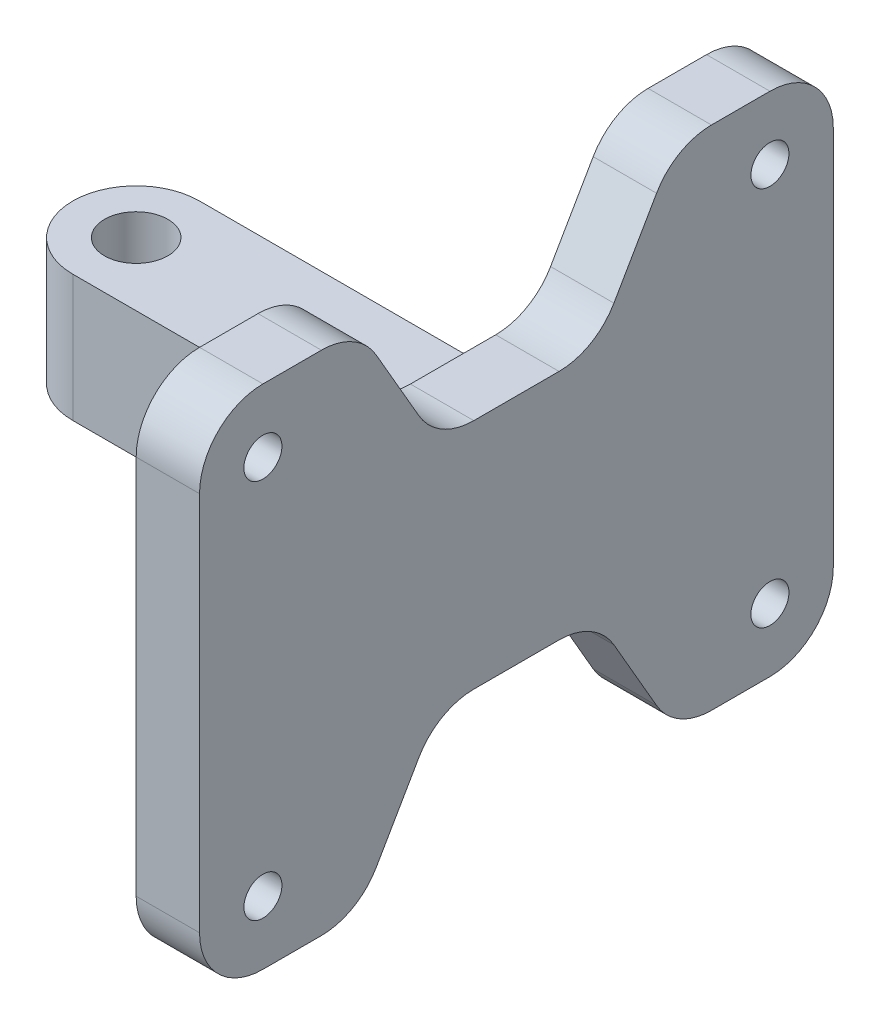
ISO-10303-21;
HEADER;
FILE_DESCRIPTION(('STEP AP214'),'2;1');
FILE_NAME('part.step','',(''),(''),'','','');
FILE_SCHEMA(('AUTOMOTIVE_DESIGN { 1 0 10303 214 1 1 1 1 }'));
ENDSEC;
DATA;
#1=APPLICATION_CONTEXT('core data for automotive mechanical design processes');
#2=APPLICATION_PROTOCOL_DEFINITION('international standard','automotive_design',2000,#1);
#3=PRODUCT_CONTEXT('',#1,'mechanical');
#4=PRODUCT('Part','Part','',(#3));
#5=PRODUCT_RELATED_PRODUCT_CATEGORY('part','',(#4));
#6=PRODUCT_DEFINITION_FORMATION('','',#4);
#7=PRODUCT_DEFINITION_CONTEXT('part definition',#1,'design');
#8=PRODUCT_DEFINITION('design','',#6,#7);
#9=PRODUCT_DEFINITION_SHAPE('','',#8);
#10=(LENGTH_UNIT() NAMED_UNIT(*) SI_UNIT(.MILLI.,.METRE.));
#11=(NAMED_UNIT(*) PLANE_ANGLE_UNIT() SI_UNIT($,.RADIAN.));
#12=(NAMED_UNIT(*) SI_UNIT($,.STERADIAN.) SOLID_ANGLE_UNIT());
#13=UNCERTAINTY_MEASURE_WITH_UNIT(LENGTH_MEASURE(1.E-05),#10,'distance_accuracy_value','');
#14=(GEOMETRIC_REPRESENTATION_CONTEXT(3) GLOBAL_UNCERTAINTY_ASSIGNED_CONTEXT((#13)) GLOBAL_UNIT_ASSIGNED_CONTEXT((#10,
#11,#12)) REPRESENTATION_CONTEXT('',''));
#15=CARTESIAN_POINT('',(0.,0.,0.));
#16=DIRECTION('',(0.,0.,1.));
#17=DIRECTION('',(1.,0.,0.));
#18=AXIS2_PLACEMENT_3D('',#15,#16,#17);
#19=CARTESIAN_POINT('',(-50.,-10.,0.));
#20=DIRECTION('',(0.,-1.,0.));
#21=DIRECTION('',(0.,0.,-1.));
#22=AXIS2_PLACEMENT_3D('',#19,#20,#21);
#23=CYLINDRICAL_SURFACE('',#22,10.);
#24=DIRECTION('',(0.,1.,0.));
#25=VECTOR('',#24,1.);
#26=CARTESIAN_POINT('',(-50.,-10.,-10.));
#27=LINE('',#26,#25);
#28=CARTESIAN_POINT('',(-50.,-10.,-10.));
#29=VERTEX_POINT('',#28);
#30=CARTESIAN_POINT('',(-50.,10.,-10.));
#31=VERTEX_POINT('',#30);
#32=EDGE_CURVE('E441',#29,#31,#27,.T.);
#33=ORIENTED_EDGE('',*,*,#32,.F.);
#34=CARTESIAN_POINT('',(-50.,-10.,0.));
#35=DIRECTION('',(0.,1.,0.));
#36=DIRECTION('',(0.,0.,1.));
#37=AXIS2_PLACEMENT_3D('',#34,#35,#36);
#38=CIRCLE('',#37,10.);
#39=CARTESIAN_POINT('',(-50.,-10.,10.));
#40=VERTEX_POINT('',#39);
#41=EDGE_CURVE('E39',#40,#29,#38,.F.);
#42=ORIENTED_EDGE('',*,*,#41,.F.);
#43=DIRECTION('',(0.,1.,0.));
#44=VECTOR('',#43,1.);
#45=CARTESIAN_POINT('',(-50.,-10.,10.));
#46=LINE('',#45,#44);
#47=CARTESIAN_POINT('',(-50.,10.,10.));
#48=VERTEX_POINT('',#47);
#49=EDGE_CURVE('E218',#48,#40,#46,.F.);
#50=ORIENTED_EDGE('',*,*,#49,.F.);
#51=CARTESIAN_POINT('',(-50.,10.,0.));
#52=DIRECTION('',(0.,-1.,0.));
#53=DIRECTION('',(0.,0.,-1.));
#54=AXIS2_PLACEMENT_3D('',#51,#52,#53);
#55=CIRCLE('',#54,10.);
#56=EDGE_CURVE('E11',#31,#48,#55,.F.);
#57=ORIENTED_EDGE('',*,*,#56,.F.);
#58=EDGE_LOOP('',(#33,#42,#50,#57));
#59=FACE_BOUND('',#58,.T.);
#60=ADVANCED_FACE('F31',(#59),#23,.T.);
#61=CARTESIAN_POINT('',(0.,40.,50.));
#62=DIRECTION('',(1.,0.,0.));
#63=DIRECTION('',(0.,0.,-1.));
#64=AXIS2_PLACEMENT_3D('',#61,#62,#63);
#65=PLANE('',#64);
#66=DIRECTION('',(0.,-0.866025403784439,0.5));
#67=VECTOR('',#66,1.);
#68=CARTESIAN_POINT('',(0.,-40.,25.));
#69=LINE('',#68,#67);
#70=CARTESIAN_POINT('',(0.,-23.349364905389,15.3867513459481));
#71=VERTEX_POINT('',#70);
#72=CARTESIAN_POINT('',(0.,-35.,22.1132486540518));
#73=VERTEX_POINT('',#72);
#74=EDGE_CURVE('E277',#71,#73,#69,.T.);
#75=ORIENTED_EDGE('',*,*,#74,.T.);
#76=CARTESIAN_POINT('',(0.,-30.,30.7735026918962));
#77=DIRECTION('',(1.,0.,0.));
#78=DIRECTION('',(0.,0.,-1.));
#79=AXIS2_PLACEMENT_3D('',#76,#77,#78);
#80=CIRCLE('',#79,10.);
#81=CARTESIAN_POINT('',(0.,-40.,30.7735026918962));
#82=VERTEX_POINT('',#81);
#83=EDGE_CURVE('E384',#73,#82,#80,.F.);
#84=ORIENTED_EDGE('',*,*,#83,.T.);
#85=DIRECTION('',(0.,0.,-1.));
#86=VECTOR('',#85,1.);
#87=CARTESIAN_POINT('',(0.,-40.,-50.));
#88=LINE('',#87,#86);
#89=CARTESIAN_POINT('',(0.,-40.,40.));
#90=VERTEX_POINT('',#89);
#91=EDGE_CURVE('E326',#90,#82,#88,.T.);
#92=ORIENTED_EDGE('',*,*,#91,.F.);
#93=CARTESIAN_POINT('',(0.,-30.,40.));
#94=DIRECTION('',(1.,0.,0.));
#95=DIRECTION('',(0.,0.,-1.));
#96=AXIS2_PLACEMENT_3D('',#93,#94,#95);
#97=CIRCLE('',#96,10.);
#98=CARTESIAN_POINT('',(0.,-30.,50.));
#99=VERTEX_POINT('',#98);
#100=EDGE_CURVE('E382',#90,#99,#97,.F.);
#101=ORIENTED_EDGE('',*,*,#100,.T.);
#102=DIRECTION('',(0.,-1.,0.));
#103=VECTOR('',#102,1.);
#104=CARTESIAN_POINT('',(0.,-40.,50.));
#105=LINE('',#104,#103);
#106=CARTESIAN_POINT('',(0.,30.,50.));
#107=VERTEX_POINT('',#106);
#108=EDGE_CURVE('E298',#107,#99,#105,.T.);
#109=ORIENTED_EDGE('',*,*,#108,.F.);
#110=CARTESIAN_POINT('',(0.,30.,40.));
#111=DIRECTION('',(1.,0.,0.));
#112=DIRECTION('',(0.,0.,-1.));
#113=AXIS2_PLACEMENT_3D('',#110,#111,#112);
#114=CIRCLE('',#113,10.);
#115=CARTESIAN_POINT('',(0.,40.,40.));
#116=VERTEX_POINT('',#115);
#117=EDGE_CURVE('E380',#107,#116,#114,.F.);
#118=ORIENTED_EDGE('',*,*,#117,.T.);
#119=DIRECTION('',(0.,0.,1.));
#120=VECTOR('',#119,1.);
#121=CARTESIAN_POINT('',(0.,40.,-50.));
#122=LINE('',#121,#120);
#123=CARTESIAN_POINT('',(0.,40.,30.7735026918963));
#124=VERTEX_POINT('',#123);
#125=EDGE_CURVE('E330',#124,#116,#122,.T.);
#126=ORIENTED_EDGE('',*,*,#125,.F.);
#127=CARTESIAN_POINT('',(0.,30.,30.7735026918962));
#128=DIRECTION('',(1.,0.,0.));
#129=DIRECTION('',(0.,0.,-1.));
#130=AXIS2_PLACEMENT_3D('',#127,#128,#129);
#131=CIRCLE('',#130,10.);
#132=CARTESIAN_POINT('',(0.,35.,22.1132486540519));
#133=VERTEX_POINT('',#132);
#134=EDGE_CURVE('E378',#124,#133,#131,.F.);
#135=ORIENTED_EDGE('',*,*,#134,.T.);
#136=DIRECTION('',(0.,-0.866025403784439,-0.5));
#137=VECTOR('',#136,1.);
#138=CARTESIAN_POINT('',(0.,40.,25.));
#139=LINE('',#138,#137);
#140=CARTESIAN_POINT('',(0.,23.349364905389,15.3867513459481));
#141=VERTEX_POINT('',#140);
#142=EDGE_CURVE('E288',#133,#141,#139,.T.);
#143=ORIENTED_EDGE('',*,*,#142,.T.);
#144=CARTESIAN_POINT('',(0.,28.349364905389,6.72649730810373));
#145=DIRECTION('',(1.,0.,0.));
#146=DIRECTION('',(0.,0.,-1.));
#147=AXIS2_PLACEMENT_3D('',#144,#145,#146);
#148=CIRCLE('',#147,10.);
#149=CARTESIAN_POINT('',(0.,18.349364905389,6.72649730810373));
#150=VERTEX_POINT('',#149);
#151=EDGE_CURVE('E435',#141,#150,#148,.T.);
#152=ORIENTED_EDGE('',*,*,#151,.T.);
#153=DIRECTION('',(0.,0.,-1.));
#154=VECTOR('',#153,1.);
#155=CARTESIAN_POINT('',(0.,18.349364905389,12.5));
#156=LINE('',#155,#154);
#157=CARTESIAN_POINT('',(0.,18.349364905389,-6.72649730810377));
#158=VERTEX_POINT('',#157);
#159=EDGE_CURVE('E291',#150,#158,#156,.T.);
#160=ORIENTED_EDGE('',*,*,#159,.T.);
#161=CARTESIAN_POINT('',(0.,28.349364905389,-6.72649730810377));
#162=DIRECTION('',(1.,0.,0.));
#163=DIRECTION('',(0.,0.,-1.));
#164=AXIS2_PLACEMENT_3D('',#161,#162,#163);
#165=CIRCLE('',#164,10.);
#166=CARTESIAN_POINT('',(0.,23.349364905389,-15.3867513459482));
#167=VERTEX_POINT('',#166);
#168=EDGE_CURVE('E439',#158,#167,#165,.T.);
#169=ORIENTED_EDGE('',*,*,#168,.T.);
#170=DIRECTION('',(0.,0.866025403784439,-0.5));
#171=VECTOR('',#170,1.);
#172=CARTESIAN_POINT('',(0.,18.349364905389,-12.5));
#173=LINE('',#172,#171);
#174=CARTESIAN_POINT('',(0.,35.,-22.1132486540519));
#175=VERTEX_POINT('',#174);
#176=EDGE_CURVE('E295',#167,#175,#173,.T.);
#177=ORIENTED_EDGE('',*,*,#176,.T.);
#178=CARTESIAN_POINT('',(0.,30.,-30.7735026918963));
#179=DIRECTION('',(1.,0.,0.));
#180=DIRECTION('',(0.,0.,-1.));
#181=AXIS2_PLACEMENT_3D('',#178,#179,#180);
#182=CIRCLE('',#181,10.);
#183=CARTESIAN_POINT('',(0.,40.,-30.7735026918963));
#184=VERTEX_POINT('',#183);
#185=EDGE_CURVE('E376',#175,#184,#182,.F.);
#186=ORIENTED_EDGE('',*,*,#185,.T.);
#187=CARTESIAN_POINT('',(0.,40.,-40.));
#188=VERTEX_POINT('',#187);
#189=EDGE_CURVE('E310',#188,#184,#122,.T.);
#190=ORIENTED_EDGE('',*,*,#189,.F.);
#191=CARTESIAN_POINT('',(0.,30.,-40.));
#192=DIRECTION('',(1.,0.,0.));
#193=DIRECTION('',(0.,0.,-1.));
#194=AXIS2_PLACEMENT_3D('',#191,#192,#193);
#195=CIRCLE('',#194,10.);
#196=CARTESIAN_POINT('',(0.,30.,-50.));
#197=VERTEX_POINT('',#196);
#198=EDGE_CURVE('E370',#188,#197,#195,.F.);
#199=ORIENTED_EDGE('',*,*,#198,.T.);
#200=DIRECTION('',(0.,1.,0.));
#201=VECTOR('',#200,1.);
#202=CARTESIAN_POINT('',(0.,-40.,-50.));
#203=LINE('',#202,#201);
#204=CARTESIAN_POINT('',(0.,-30.,-50.));
#205=VERTEX_POINT('',#204);
#206=EDGE_CURVE('E327',#205,#197,#203,.T.);
#207=ORIENTED_EDGE('',*,*,#206,.F.);
#208=CARTESIAN_POINT('',(0.,-30.,-40.));
#209=DIRECTION('',(1.,0.,0.));
#210=DIRECTION('',(0.,0.,-1.));
#211=AXIS2_PLACEMENT_3D('',#208,#209,#210);
#212=CIRCLE('',#211,10.);
#213=CARTESIAN_POINT('',(0.,-40.,-40.));
#214=VERTEX_POINT('',#213);
#215=EDGE_CURVE('E374',#205,#214,#212,.F.);
#216=ORIENTED_EDGE('',*,*,#215,.T.);
#217=CARTESIAN_POINT('',(0.,-40.,-30.7735026918963));
#218=VERTEX_POINT('',#217);
#219=EDGE_CURVE('E323',#218,#214,#88,.T.);
#220=ORIENTED_EDGE('',*,*,#219,.F.);
#221=CARTESIAN_POINT('',(0.,-30.,-30.7735026918963));
#222=DIRECTION('',(1.,0.,0.));
#223=DIRECTION('',(0.,0.,-1.));
#224=AXIS2_PLACEMENT_3D('',#221,#222,#223);
#225=CIRCLE('',#224,10.);
#226=CARTESIAN_POINT('',(0.,-35.,-22.1132486540519));
#227=VERTEX_POINT('',#226);
#228=EDGE_CURVE('E372',#218,#227,#225,.F.);
#229=ORIENTED_EDGE('',*,*,#228,.T.);
#230=DIRECTION('',(0.,0.866025403784439,0.5));
#231=VECTOR('',#230,1.);
#232=CARTESIAN_POINT('',(0.,-18.349364905389,-12.5));
#233=LINE('',#232,#231);
#234=CARTESIAN_POINT('',(0.,-23.349364905389,-15.3867513459482));
#235=VERTEX_POINT('',#234);
#236=EDGE_CURVE('E270',#227,#235,#233,.T.);
#237=ORIENTED_EDGE('',*,*,#236,.T.);
#238=CARTESIAN_POINT('',(0.,-28.349364905389,-6.72649730810377));
#239=DIRECTION('',(1.,0.,0.));
#240=DIRECTION('',(0.,0.,-1.));
#241=AXIS2_PLACEMENT_3D('',#238,#239,#240);
#242=CIRCLE('',#241,10.);
#243=CARTESIAN_POINT('',(0.,-18.349364905389,-6.72649730810377));
#244=VERTEX_POINT('',#243);
#245=EDGE_CURVE('E427',#235,#244,#242,.T.);
#246=ORIENTED_EDGE('',*,*,#245,.T.);
#247=DIRECTION('',(0.,0.,1.));
#248=VECTOR('',#247,1.);
#249=CARTESIAN_POINT('',(0.,-18.349364905389,12.5));
#250=LINE('',#249,#248);
#251=CARTESIAN_POINT('',(0.,-18.349364905389,6.72649730810373));
#252=VERTEX_POINT('',#251);
#253=EDGE_CURVE('E273',#244,#252,#250,.T.);
#254=ORIENTED_EDGE('',*,*,#253,.T.);
#255=CARTESIAN_POINT('',(0.,-28.349364905389,6.72649730810373));
#256=DIRECTION('',(1.,0.,0.));
#257=DIRECTION('',(0.,0.,-1.));
#258=AXIS2_PLACEMENT_3D('',#255,#256,#257);
#259=CIRCLE('',#258,10.);
#260=EDGE_CURVE('E431',#252,#71,#259,.T.);
#261=ORIENTED_EDGE('',*,*,#260,.T.);
#262=EDGE_LOOP('',(#75,#84,#92,#101,#109,#118,#126,#135,#143,#152,#160,#169,#177,#186,#190,#199,
#207,#216,#220,#229,#237,#246,#254,#261));
#263=FACE_BOUND('',#262,.T.);
#264=CARTESIAN_POINT('',(0.,30.,40.));
#265=DIRECTION('',(1.,0.,0.));
#266=DIRECTION('',(0.,0.,-1.));
#267=AXIS2_PLACEMENT_3D('',#264,#265,#266);
#268=CIRCLE('',#267,3.);
#269=CARTESIAN_POINT('',(0.,30.,37.));
#270=VERTEX_POINT('',#269);
#271=EDGE_CURVE('E264',#270,#270,#268,.T.);
#272=ORIENTED_EDGE('',*,*,#271,.T.);
#273=EDGE_LOOP('',(#272));
#274=FACE_BOUND('',#273,.T.);
#275=CARTESIAN_POINT('',(0.,30.,-40.));
#276=DIRECTION('',(1.,0.,0.));
#277=DIRECTION('',(0.,0.,1.));
#278=AXIS2_PLACEMENT_3D('',#275,#276,#277);
#279=CIRCLE('',#278,3.);
#280=CARTESIAN_POINT('',(0.,30.,-37.));
#281=VERTEX_POINT('',#280);
#282=EDGE_CURVE('E258',#281,#281,#279,.T.);
#283=ORIENTED_EDGE('',*,*,#282,.T.);
#284=EDGE_LOOP('',(#283));
#285=FACE_BOUND('',#284,.T.);
#286=CARTESIAN_POINT('',(0.,-30.,-40.));
#287=DIRECTION('',(1.,0.,0.));
#288=DIRECTION('',(0.,0.,-1.));
#289=AXIS2_PLACEMENT_3D('',#286,#287,#288);
#290=CIRCLE('',#289,3.);
#291=CARTESIAN_POINT('',(0.,-30.,-43.));
#292=VERTEX_POINT('',#291);
#293=EDGE_CURVE('E252',#292,#292,#290,.T.);
#294=ORIENTED_EDGE('',*,*,#293,.T.);
#295=EDGE_LOOP('',(#294));
#296=FACE_BOUND('',#295,.T.);
#297=CARTESIAN_POINT('',(0.,-30.,40.));
#298=DIRECTION('',(1.,0.,0.));
#299=DIRECTION('',(0.,0.,1.));
#300=AXIS2_PLACEMENT_3D('',#297,#298,#299);
#301=CIRCLE('',#300,3.);
#302=CARTESIAN_POINT('',(0.,-30.,43.));
#303=VERTEX_POINT('',#302);
#304=EDGE_CURVE('E246',#303,#303,#301,.T.);
#305=ORIENTED_EDGE('',*,*,#304,.T.);
#306=EDGE_LOOP('',(#305));
#307=FACE_BOUND('',#306,.T.);
#308=DIRECTION('',(0.,1.,0.));
#309=VECTOR('',#308,1.);
#310=CARTESIAN_POINT('',(0.,10.,10.));
#311=LINE('',#310,#309);
#312=CARTESIAN_POINT('',(0.,-10.,10.));
#313=VERTEX_POINT('',#312);
#314=CARTESIAN_POINT('',(0.,10.,10.));
#315=VERTEX_POINT('',#314);
#316=EDGE_CURVE('E217',#313,#315,#311,.T.);
#317=ORIENTED_EDGE('',*,*,#316,.F.);
#318=DIRECTION('',(0.,0.,1.));
#319=VECTOR('',#318,1.);
#320=CARTESIAN_POINT('',(0.,-10.,-10.));
#321=LINE('',#320,#319);
#322=CARTESIAN_POINT('',(0.,-10.,-10.));
#323=VERTEX_POINT('',#322);
#324=EDGE_CURVE('E222',#323,#313,#321,.T.);
#325=ORIENTED_EDGE('',*,*,#324,.F.);
#326=DIRECTION('',(0.,-1.,0.));
#327=VECTOR('',#326,1.);
#328=CARTESIAN_POINT('',(0.,10.,-10.));
#329=LINE('',#328,#327);
#330=CARTESIAN_POINT('',(0.,9.99999999999999,-10.));
#331=VERTEX_POINT('',#330);
#332=EDGE_CURVE('E235',#331,#323,#329,.T.);
#333=ORIENTED_EDGE('',*,*,#332,.F.);
#334=DIRECTION('',(0.,0.,-1.));
#335=VECTOR('',#334,1.);
#336=CARTESIAN_POINT('',(0.,10.,-10.));
#337=LINE('',#336,#335);
#338=EDGE_CURVE('E231',#315,#331,#337,.T.);
#339=ORIENTED_EDGE('',*,*,#338,.F.);
#340=EDGE_LOOP('',(#317,#325,#333,#339));
#341=FACE_BOUND('',#340,.T.);
#342=ADVANCED_FACE('F227',(#263,#274,#285,#296,#307,#341),#65,.F.);
#343=CARTESIAN_POINT('',(10.,-40.,-50.));
#344=DIRECTION('',(0.,1.,0.));
#345=DIRECTION('',(0.,0.,1.));
#346=AXIS2_PLACEMENT_3D('',#343,#344,#345);
#347=PLANE('',#346);
#348=ORIENTED_EDGE('',*,*,#219,.T.);
#349=DIRECTION('',(-1.,0.,0.));
#350=VECTOR('',#349,1.);
#351=CARTESIAN_POINT('',(10.,-40.,-40.));
#352=LINE('',#351,#350);
#353=CARTESIAN_POINT('',(10.,-40.,-40.));
#354=VERTEX_POINT('',#353);
#355=EDGE_CURVE('E423',#214,#354,#352,.F.);
#356=ORIENTED_EDGE('',*,*,#355,.T.);
#357=DIRECTION('',(0.,0.,-1.));
#358=VECTOR('',#357,1.);
#359=CARTESIAN_POINT('',(10.,-40.,-50.));
#360=LINE('',#359,#358);
#361=CARTESIAN_POINT('',(10.,-40.,-30.7735026918963));
#362=VERTEX_POINT('',#361);
#363=EDGE_CURVE('E309',#362,#354,#360,.T.);
#364=ORIENTED_EDGE('',*,*,#363,.F.);
#365=DIRECTION('',(1.,0.,0.));
#366=VECTOR('',#365,1.);
#367=CARTESIAN_POINT('',(10.,-40.,-30.7735026918963));
#368=LINE('',#367,#366);
#369=EDGE_CURVE('E421',#362,#218,#368,.F.);
#370=ORIENTED_EDGE('',*,*,#369,.T.);
#371=EDGE_LOOP('',(#348,#356,#364,#370));
#372=FACE_BOUND('',#371,.T.);
#373=ADVANCED_FACE('F468',(#372),#347,.F.);
#374=CARTESIAN_POINT('',(10.,40.,-50.));
#375=DIRECTION('',(0.,-1.,0.));
#376=DIRECTION('',(0.,0.,-1.));
#377=AXIS2_PLACEMENT_3D('',#374,#375,#376);
#378=PLANE('',#377);
#379=ORIENTED_EDGE('',*,*,#189,.T.);
#380=DIRECTION('',(1.,0.,0.));
#381=VECTOR('',#380,1.);
#382=CARTESIAN_POINT('',(10.,40.,-30.7735026918963));
#383=LINE('',#382,#381);
#384=CARTESIAN_POINT('',(10.,40.,-30.7735026918963));
#385=VERTEX_POINT('',#384);
#386=EDGE_CURVE('E413',#184,#385,#383,.T.);
#387=ORIENTED_EDGE('',*,*,#386,.T.);
#388=DIRECTION('',(0.,0.,1.));
#389=VECTOR('',#388,1.);
#390=CARTESIAN_POINT('',(10.,40.,-50.));
#391=LINE('',#390,#389);
#392=CARTESIAN_POINT('',(10.,40.,-40.));
#393=VERTEX_POINT('',#392);
#394=EDGE_CURVE('E320',#393,#385,#391,.T.);
#395=ORIENTED_EDGE('',*,*,#394,.F.);
#396=DIRECTION('',(-1.,0.,0.));
#397=VECTOR('',#396,1.);
#398=CARTESIAN_POINT('',(10.,40.,-40.));
#399=LINE('',#398,#397);
#400=EDGE_CURVE('E410',#393,#188,#399,.T.);
#401=ORIENTED_EDGE('',*,*,#400,.T.);
#402=EDGE_LOOP('',(#379,#387,#395,#401));
#403=FACE_BOUND('',#402,.T.);
#404=ADVANCED_FACE('F474',(#403),#378,.F.);
#405=CARTESIAN_POINT('',(10.,-40.,50.));
#406=DIRECTION('',(0.,0.,-1.));
#407=DIRECTION('',(-1.,0.,0.));
#408=AXIS2_PLACEMENT_3D('',#405,#406,#407);
#409=PLANE('',#408);
#410=ORIENTED_EDGE('',*,*,#108,.T.);
#411=DIRECTION('',(-1.,0.,0.));
#412=VECTOR('',#411,1.);
#413=CARTESIAN_POINT('',(10.,-30.,50.));
#414=LINE('',#413,#412);
#415=CARTESIAN_POINT('',(10.,-30.,50.));
#416=VERTEX_POINT('',#415);
#417=EDGE_CURVE('E389',#99,#416,#414,.F.);
#418=ORIENTED_EDGE('',*,*,#417,.T.);
#419=DIRECTION('',(0.,-1.,0.));
#420=VECTOR('',#419,1.);
#421=CARTESIAN_POINT('',(10.,-40.,50.));
#422=LINE('',#421,#420);
#423=CARTESIAN_POINT('',(10.,30.,50.));
#424=VERTEX_POINT('',#423);
#425=EDGE_CURVE('E306',#424,#416,#422,.T.);
#426=ORIENTED_EDGE('',*,*,#425,.F.);
#427=DIRECTION('',(-1.,0.,0.));
#428=VECTOR('',#427,1.);
#429=CARTESIAN_POINT('',(10.,30.,50.));
#430=LINE('',#429,#428);
#431=EDGE_CURVE('E386',#424,#107,#430,.T.);
#432=ORIENTED_EDGE('',*,*,#431,.T.);
#433=EDGE_LOOP('',(#410,#418,#426,#432));
#434=FACE_BOUND('',#433,.T.);
#435=ADVANCED_FACE('F492',(#434),#409,.F.);
#436=ORIENTED_EDGE('',*,*,#91,.T.);
#437=DIRECTION('',(1.,0.,0.));
#438=VECTOR('',#437,1.);
#439=CARTESIAN_POINT('',(9.99999999999999,-40.,30.7735026918962));
#440=LINE('',#439,#438);
#441=CARTESIAN_POINT('',(10.,-40.,30.7735026918962));
#442=VERTEX_POINT('',#441);
#443=EDGE_CURVE('E351',#82,#442,#440,.T.);
#444=ORIENTED_EDGE('',*,*,#443,.T.);
#445=CARTESIAN_POINT('',(10.,-40.,40.));
#446=VERTEX_POINT('',#445);
#447=EDGE_CURVE('E313',#446,#442,#360,.T.);
#448=ORIENTED_EDGE('',*,*,#447,.F.);
#449=DIRECTION('',(-1.,0.,0.));
#450=VECTOR('',#449,1.);
#451=CARTESIAN_POINT('',(10.,-40.,40.));
#452=LINE('',#451,#450);
#453=EDGE_CURVE('E348',#446,#90,#452,.T.);
#454=ORIENTED_EDGE('',*,*,#453,.T.);
#455=EDGE_LOOP('',(#436,#444,#448,#454));
#456=FACE_BOUND('',#455,.T.);
#457=ADVANCED_FACE('F477',(#456),#347,.F.);
#458=CARTESIAN_POINT('',(10.,-40.,-50.));
#459=DIRECTION('',(0.,0.,1.));
#460=DIRECTION('',(1.,0.,0.));
#461=AXIS2_PLACEMENT_3D('',#458,#459,#460);
#462=PLANE('',#461);
#463=DIRECTION('',(0.,1.,0.));
#464=VECTOR('',#463,1.);
#465=CARTESIAN_POINT('',(10.,-40.,-50.));
#466=LINE('',#465,#464);
#467=CARTESIAN_POINT('',(10.,-30.,-50.));
#468=VERTEX_POINT('',#467);
#469=CARTESIAN_POINT('',(10.,30.,-50.));
#470=VERTEX_POINT('',#469);
#471=EDGE_CURVE('E314',#468,#470,#466,.T.);
#472=ORIENTED_EDGE('',*,*,#471,.F.);
#473=DIRECTION('',(-1.,0.,0.));
#474=VECTOR('',#473,1.);
#475=CARTESIAN_POINT('',(10.,-30.,-50.));
#476=LINE('',#475,#474);
#477=EDGE_CURVE('E418',#468,#205,#476,.T.);
#478=ORIENTED_EDGE('',*,*,#477,.T.);
#479=ORIENTED_EDGE('',*,*,#206,.T.);
#480=DIRECTION('',(-1.,0.,0.));
#481=VECTOR('',#480,1.);
#482=CARTESIAN_POINT('',(10.,30.,-50.));
#483=LINE('',#482,#481);
#484=EDGE_CURVE('E416',#197,#470,#483,.F.);
#485=ORIENTED_EDGE('',*,*,#484,.T.);
#486=EDGE_LOOP('',(#472,#478,#479,#485));
#487=FACE_BOUND('',#486,.T.);
#488=ADVANCED_FACE('F486',(#487),#462,.F.);
#489=ORIENTED_EDGE('',*,*,#125,.T.);
#490=DIRECTION('',(-1.,0.,0.));
#491=VECTOR('',#490,1.);
#492=CARTESIAN_POINT('',(10.,40.,40.));
#493=LINE('',#492,#491);
#494=CARTESIAN_POINT('',(10.,40.,40.));
#495=VERTEX_POINT('',#494);
#496=EDGE_CURVE('E393',#116,#495,#493,.F.);
#497=ORIENTED_EDGE('',*,*,#496,.T.);
#498=CARTESIAN_POINT('',(10.,40.,30.7735026918963));
#499=VERTEX_POINT('',#498);
#500=EDGE_CURVE('E317',#499,#495,#391,.T.);
#501=ORIENTED_EDGE('',*,*,#500,.F.);
#502=DIRECTION('',(1.,0.,0.));
#503=VECTOR('',#502,1.);
#504=CARTESIAN_POINT('',(9.99999999999999,40.,30.7735026918963));
#505=LINE('',#504,#503);
#506=EDGE_CURVE('E391',#499,#124,#505,.F.);
#507=ORIENTED_EDGE('',*,*,#506,.T.);
#508=EDGE_LOOP('',(#489,#497,#501,#507));
#509=FACE_BOUND('',#508,.T.);
#510=ADVANCED_FACE('F483',(#509),#378,.F.);
#511=CARTESIAN_POINT('',(10.,40.,50.));
#512=DIRECTION('',(1.,0.,0.));
#513=DIRECTION('',(0.,0.,-1.));
#514=AXIS2_PLACEMENT_3D('',#511,#512,#513);
#515=PLANE('',#514);
#516=CARTESIAN_POINT('',(10.,-30.,40.));
#517=DIRECTION('',(1.,0.,0.));
#518=DIRECTION('',(0.,0.,1.));
#519=AXIS2_PLACEMENT_3D('',#516,#517,#518);
#520=CIRCLE('',#519,3.);
#521=CARTESIAN_POINT('',(10.,-30.,43.));
#522=VERTEX_POINT('',#521);
#523=EDGE_CURVE('E245',#522,#522,#520,.T.);
#524=ORIENTED_EDGE('',*,*,#523,.F.);
#525=EDGE_LOOP('',(#524));
#526=FACE_BOUND('',#525,.T.);
#527=CARTESIAN_POINT('',(10.,-30.,-40.));
#528=DIRECTION('',(1.,0.,0.));
#529=DIRECTION('',(0.,0.,-1.));
#530=AXIS2_PLACEMENT_3D('',#527,#528,#529);
#531=CIRCLE('',#530,3.);
#532=CARTESIAN_POINT('',(10.,-30.,-43.));
#533=VERTEX_POINT('',#532);
#534=EDGE_CURVE('E249',#533,#533,#531,.T.);
#535=ORIENTED_EDGE('',*,*,#534,.F.);
#536=EDGE_LOOP('',(#535));
#537=FACE_BOUND('',#536,.T.);
#538=CARTESIAN_POINT('',(10.,30.,-40.));
#539=DIRECTION('',(1.,0.,0.));
#540=DIRECTION('',(0.,0.,1.));
#541=AXIS2_PLACEMENT_3D('',#538,#539,#540);
#542=CIRCLE('',#541,3.);
#543=CARTESIAN_POINT('',(10.,30.,-37.));
#544=VERTEX_POINT('',#543);
#545=EDGE_CURVE('E255',#544,#544,#542,.T.);
#546=ORIENTED_EDGE('',*,*,#545,.F.);
#547=EDGE_LOOP('',(#546));
#548=FACE_BOUND('',#547,.T.);
#549=CARTESIAN_POINT('',(10.,30.,40.));
#550=DIRECTION('',(1.,0.,0.));
#551=DIRECTION('',(0.,0.,-1.));
#552=AXIS2_PLACEMENT_3D('',#549,#550,#551);
#553=CIRCLE('',#552,3.);
#554=CARTESIAN_POINT('',(10.,30.,37.));
#555=VERTEX_POINT('',#554);
#556=EDGE_CURVE('E261',#555,#555,#553,.T.);
#557=ORIENTED_EDGE('',*,*,#556,.F.);
#558=EDGE_LOOP('',(#557));
#559=FACE_BOUND('',#558,.T.);
#560=ORIENTED_EDGE('',*,*,#447,.T.);
#561=CARTESIAN_POINT('',(10.,-30.,30.7735026918962));
#562=DIRECTION('',(1.,0.,0.));
#563=DIRECTION('',(0.,0.,-1.));
#564=AXIS2_PLACEMENT_3D('',#561,#562,#563);
#565=CIRCLE('',#564,10.);
#566=CARTESIAN_POINT('',(10.,-35.,22.1132486540518));
#567=VERTEX_POINT('',#566);
#568=EDGE_CURVE('E368',#442,#567,#565,.T.);
#569=ORIENTED_EDGE('',*,*,#568,.T.);
#570=DIRECTION('',(0.,-0.866025403784439,0.5));
#571=VECTOR('',#570,1.);
#572=CARTESIAN_POINT('',(10.,-40.,25.));
#573=LINE('',#572,#571);
#574=CARTESIAN_POINT('',(10.,-23.349364905389,15.3867513459481));
#575=VERTEX_POINT('',#574);
#576=EDGE_CURVE('E274',#575,#567,#573,.T.);
#577=ORIENTED_EDGE('',*,*,#576,.F.);
#578=CARTESIAN_POINT('',(10.,-28.349364905389,6.72649730810373));
#579=DIRECTION('',(1.,0.,0.));
#580=DIRECTION('',(0.,0.,-1.));
#581=AXIS2_PLACEMENT_3D('',#578,#579,#580);
#582=CIRCLE('',#581,10.);
#583=CARTESIAN_POINT('',(10.,-18.349364905389,6.72649730810374));
#584=VERTEX_POINT('',#583);
#585=EDGE_CURVE('E429',#575,#584,#582,.F.);
#586=ORIENTED_EDGE('',*,*,#585,.T.);
#587=DIRECTION('',(0.,0.,1.));
#588=VECTOR('',#587,1.);
#589=CARTESIAN_POINT('',(10.,-18.349364905389,12.5));
#590=LINE('',#589,#588);
#591=CARTESIAN_POINT('',(10.,-18.349364905389,-6.72649730810377));
#592=VERTEX_POINT('',#591);
#593=EDGE_CURVE('E283',#592,#584,#590,.T.);
#594=ORIENTED_EDGE('',*,*,#593,.F.);
#595=CARTESIAN_POINT('',(10.,-28.349364905389,-6.72649730810377));
#596=DIRECTION('',(1.,0.,0.));
#597=DIRECTION('',(0.,0.,-1.));
#598=AXIS2_PLACEMENT_3D('',#595,#596,#597);
#599=CIRCLE('',#598,10.);
#600=CARTESIAN_POINT('',(10.,-23.349364905389,-15.3867513459482));
#601=VERTEX_POINT('',#600);
#602=EDGE_CURVE('E425',#592,#601,#599,.F.);
#603=ORIENTED_EDGE('',*,*,#602,.T.);
#604=DIRECTION('',(0.,0.866025403784439,0.5));
#605=VECTOR('',#604,1.);
#606=CARTESIAN_POINT('',(10.,-18.349364905389,-12.5));
#607=LINE('',#606,#605);
#608=CARTESIAN_POINT('',(10.,-35.,-22.1132486540519));
#609=VERTEX_POINT('',#608);
#610=EDGE_CURVE('E267',#609,#601,#607,.T.);
#611=ORIENTED_EDGE('',*,*,#610,.F.);
#612=CARTESIAN_POINT('',(10.,-30.,-30.7735026918963));
#613=DIRECTION('',(1.,0.,0.));
#614=DIRECTION('',(0.,0.,-1.));
#615=AXIS2_PLACEMENT_3D('',#612,#613,#614);
#616=CIRCLE('',#615,10.);
#617=EDGE_CURVE('E356',#609,#362,#616,.T.);
#618=ORIENTED_EDGE('',*,*,#617,.T.);
#619=ORIENTED_EDGE('',*,*,#363,.T.);
#620=CARTESIAN_POINT('',(10.,-30.,-40.));
#621=DIRECTION('',(1.,0.,0.));
#622=DIRECTION('',(0.,0.,-1.));
#623=AXIS2_PLACEMENT_3D('',#620,#621,#622);
#624=CIRCLE('',#623,10.);
#625=EDGE_CURVE('E358',#354,#468,#624,.T.);
#626=ORIENTED_EDGE('',*,*,#625,.T.);
#627=ORIENTED_EDGE('',*,*,#471,.T.);
#628=CARTESIAN_POINT('',(10.,30.,-40.));
#629=DIRECTION('',(1.,0.,0.));
#630=DIRECTION('',(0.,0.,-1.));
#631=AXIS2_PLACEMENT_3D('',#628,#629,#630);
#632=CIRCLE('',#631,10.);
#633=EDGE_CURVE('E354',#470,#393,#632,.T.);
#634=ORIENTED_EDGE('',*,*,#633,.T.);
#635=ORIENTED_EDGE('',*,*,#394,.T.);
#636=CARTESIAN_POINT('',(10.,30.,-30.7735026918963));
#637=DIRECTION('',(1.,0.,0.));
#638=DIRECTION('',(0.,0.,-1.));
#639=AXIS2_PLACEMENT_3D('',#636,#637,#638);
#640=CIRCLE('',#639,10.);
#641=CARTESIAN_POINT('',(10.,35.,-22.1132486540519));
#642=VERTEX_POINT('',#641);
#643=EDGE_CURVE('E360',#385,#642,#640,.T.);
#644=ORIENTED_EDGE('',*,*,#643,.T.);
#645=DIRECTION('',(0.,0.866025403784439,-0.5));
#646=VECTOR('',#645,1.);
#647=CARTESIAN_POINT('',(10.,18.349364905389,-12.5));
#648=LINE('',#647,#646);
#649=CARTESIAN_POINT('',(10.,23.349364905389,-15.3867513459482));
#650=VERTEX_POINT('',#649);
#651=EDGE_CURVE('E292',#650,#642,#648,.T.);
#652=ORIENTED_EDGE('',*,*,#651,.F.);
#653=CARTESIAN_POINT('',(10.,28.349364905389,-6.72649730810377));
#654=DIRECTION('',(1.,0.,0.));
#655=DIRECTION('',(0.,0.,-1.));
#656=AXIS2_PLACEMENT_3D('',#653,#654,#655);
#657=CIRCLE('',#656,10.);
#658=CARTESIAN_POINT('',(10.,18.349364905389,-6.72649730810377));
#659=VERTEX_POINT('',#658);
#660=EDGE_CURVE('E437',#650,#659,#657,.F.);
#661=ORIENTED_EDGE('',*,*,#660,.T.);
#662=DIRECTION('',(0.,0.,-1.));
#663=VECTOR('',#662,1.);
#664=CARTESIAN_POINT('',(10.,18.349364905389,12.5));
#665=LINE('',#664,#663);
#666=CARTESIAN_POINT('',(10.,18.349364905389,6.72649730810373));
#667=VERTEX_POINT('',#666);
#668=EDGE_CURVE('E301',#667,#659,#665,.T.);
#669=ORIENTED_EDGE('',*,*,#668,.F.);
#670=CARTESIAN_POINT('',(10.,28.349364905389,6.72649730810373));
#671=DIRECTION('',(1.,0.,0.));
#672=DIRECTION('',(0.,0.,-1.));
#673=AXIS2_PLACEMENT_3D('',#670,#671,#672);
#674=CIRCLE('',#673,10.);
#675=CARTESIAN_POINT('',(10.,23.349364905389,15.3867513459481));
#676=VERTEX_POINT('',#675);
#677=EDGE_CURVE('E433',#667,#676,#674,.F.);
#678=ORIENTED_EDGE('',*,*,#677,.T.);
#679=DIRECTION('',(0.,-0.866025403784439,-0.5));
#680=VECTOR('',#679,1.);
#681=CARTESIAN_POINT('',(10.,40.,25.));
#682=LINE('',#681,#680);
#683=CARTESIAN_POINT('',(10.,35.,22.1132486540519));
#684=VERTEX_POINT('',#683);
#685=EDGE_CURVE('E280',#684,#676,#682,.T.);
#686=ORIENTED_EDGE('',*,*,#685,.F.);
#687=CARTESIAN_POINT('',(10.,30.,30.7735026918962));
#688=DIRECTION('',(1.,0.,0.));
#689=DIRECTION('',(0.,0.,-1.));
#690=AXIS2_PLACEMENT_3D('',#687,#688,#689);
#691=CIRCLE('',#690,10.);
#692=EDGE_CURVE('E362',#684,#499,#691,.T.);
#693=ORIENTED_EDGE('',*,*,#692,.T.);
#694=ORIENTED_EDGE('',*,*,#500,.T.);
#695=CARTESIAN_POINT('',(10.,30.,40.));
#696=DIRECTION('',(1.,0.,0.));
#697=DIRECTION('',(0.,0.,-1.));
#698=AXIS2_PLACEMENT_3D('',#695,#696,#697);
#699=CIRCLE('',#698,10.);
#700=EDGE_CURVE('E364',#495,#424,#699,.T.);
#701=ORIENTED_EDGE('',*,*,#700,.T.);
#702=ORIENTED_EDGE('',*,*,#425,.T.);
#703=CARTESIAN_POINT('',(10.,-30.,40.));
#704=DIRECTION('',(1.,0.,0.));
#705=DIRECTION('',(0.,0.,-1.));
#706=AXIS2_PLACEMENT_3D('',#703,#704,#705);
#707=CIRCLE('',#706,10.);
#708=EDGE_CURVE('E366',#416,#446,#707,.T.);
#709=ORIENTED_EDGE('',*,*,#708,.T.);
#710=EDGE_LOOP('',(#560,#569,#577,#586,#594,#603,#611,#618,#619,#626,#627,#634,#635,#644,#652,
#661,#669,#678,#686,#693,#694,#701,#702,#709));
#711=FACE_BOUND('',#710,.T.);
#712=ADVANCED_FACE('F481',(#526,#537,#548,#559,#711),#515,.T.);
#713=CARTESIAN_POINT('',(0.,18.349364905389,-12.5));
#714=DIRECTION('',(0.,-0.5,-0.866025403784439));
#715=DIRECTION('',(0.,0.866025403784439,-0.5));
#716=AXIS2_PLACEMENT_3D('',#713,#714,#715);
#717=PLANE('',#716);
#718=ORIENTED_EDGE('',*,*,#176,.F.);
#719=DIRECTION('',(1.,0.,0.));
#720=VECTOR('',#719,1.);
#721=CARTESIAN_POINT('',(10.,23.349364905389,-15.3867513459482));
#722=LINE('',#721,#720);
#723=EDGE_CURVE('E407',#167,#650,#722,.T.);
#724=ORIENTED_EDGE('',*,*,#723,.T.);
#725=ORIENTED_EDGE('',*,*,#651,.T.);
#726=DIRECTION('',(1.,0.,0.));
#727=VECTOR('',#726,1.);
#728=CARTESIAN_POINT('',(0.,35.,-22.1132486540519));
#729=LINE('',#728,#727);
#730=EDGE_CURVE('E405',#642,#175,#729,.F.);
#731=ORIENTED_EDGE('',*,*,#730,.T.);
#732=EDGE_LOOP('',(#718,#724,#725,#731));
#733=FACE_BOUND('',#732,.T.);
#734=ADVANCED_FACE('F564',(#733),#717,.F.);
#735=CARTESIAN_POINT('',(0.,18.349364905389,12.5));
#736=DIRECTION('',(0.,-1.,0.));
#737=DIRECTION('',(0.,0.,-1.));
#738=AXIS2_PLACEMENT_3D('',#735,#736,#737);
#739=PLANE('',#738);
#740=ORIENTED_EDGE('',*,*,#159,.F.);
#741=DIRECTION('',(1.,0.,0.));
#742=VECTOR('',#741,1.);
#743=CARTESIAN_POINT('',(10.,18.349364905389,6.72649730810373));
#744=LINE('',#743,#742);
#745=EDGE_CURVE('E402',#150,#667,#744,.T.);
#746=ORIENTED_EDGE('',*,*,#745,.T.);
#747=ORIENTED_EDGE('',*,*,#668,.T.);
#748=DIRECTION('',(1.,0.,0.));
#749=VECTOR('',#748,1.);
#750=CARTESIAN_POINT('',(0.,18.349364905389,-6.72649730810377));
#751=LINE('',#750,#749);
#752=EDGE_CURVE('E400',#659,#158,#751,.F.);
#753=ORIENTED_EDGE('',*,*,#752,.T.);
#754=EDGE_LOOP('',(#740,#746,#747,#753));
#755=FACE_BOUND('',#754,.T.);
#756=ADVANCED_FACE('F571',(#755),#739,.F.);
#757=CARTESIAN_POINT('',(0.,40.,25.));
#758=DIRECTION('',(0.,-0.5,0.866025403784438));
#759=DIRECTION('',(0.,-0.866025403784439,-0.5));
#760=AXIS2_PLACEMENT_3D('',#757,#758,#759);
#761=PLANE('',#760);
#762=ORIENTED_EDGE('',*,*,#142,.F.);
#763=DIRECTION('',(1.,0.,0.));
#764=VECTOR('',#763,1.);
#765=CARTESIAN_POINT('',(0.,35.,22.1132486540519));
#766=LINE('',#765,#764);
#767=EDGE_CURVE('E397',#133,#684,#766,.T.);
#768=ORIENTED_EDGE('',*,*,#767,.T.);
#769=ORIENTED_EDGE('',*,*,#685,.T.);
#770=DIRECTION('',(1.,0.,0.));
#771=VECTOR('',#770,1.);
#772=CARTESIAN_POINT('',(0.,23.349364905389,15.3867513459481));
#773=LINE('',#772,#771);
#774=EDGE_CURVE('E395',#676,#141,#773,.F.);
#775=ORIENTED_EDGE('',*,*,#774,.T.);
#776=EDGE_LOOP('',(#762,#768,#769,#775));
#777=FACE_BOUND('',#776,.T.);
#778=ADVANCED_FACE('F578',(#777),#761,.F.);
#779=CARTESIAN_POINT('',(0.,-18.349364905389,-12.5));
#780=DIRECTION('',(0.,0.5,-0.866025403784439));
#781=DIRECTION('',(0.,0.866025403784439,0.5));
#782=AXIS2_PLACEMENT_3D('',#779,#780,#781);
#783=PLANE('',#782);
#784=ORIENTED_EDGE('',*,*,#610,.T.);
#785=DIRECTION('',(1.,0.,0.));
#786=VECTOR('',#785,1.);
#787=CARTESIAN_POINT('',(0.,-23.349364905389,-15.3867513459482));
#788=LINE('',#787,#786);
#789=EDGE_CURVE('E341',#601,#235,#788,.F.);
#790=ORIENTED_EDGE('',*,*,#789,.T.);
#791=ORIENTED_EDGE('',*,*,#236,.F.);
#792=DIRECTION('',(1.,0.,0.));
#793=VECTOR('',#792,1.);
#794=CARTESIAN_POINT('',(0.,-35.,-22.1132486540519));
#795=LINE('',#794,#793);
#796=EDGE_CURVE('E338',#227,#609,#795,.T.);
#797=ORIENTED_EDGE('',*,*,#796,.T.);
#798=EDGE_LOOP('',(#784,#790,#791,#797));
#799=FACE_BOUND('',#798,.T.);
#800=ADVANCED_FACE('F615',(#799),#783,.F.);
#801=CARTESIAN_POINT('',(0.,-40.,25.));
#802=DIRECTION('',(0.,0.5,0.866025403784439));
#803=DIRECTION('',(0.,-0.866025403784439,0.5));
#804=AXIS2_PLACEMENT_3D('',#801,#802,#803);
#805=PLANE('',#804);
#806=ORIENTED_EDGE('',*,*,#74,.F.);
#807=DIRECTION('',(1.,0.,0.));
#808=VECTOR('',#807,1.);
#809=CARTESIAN_POINT('',(10.,-23.3493649053891,15.3867513459481));
#810=LINE('',#809,#808);
#811=EDGE_CURVE('E345',#71,#575,#810,.T.);
#812=ORIENTED_EDGE('',*,*,#811,.T.);
#813=ORIENTED_EDGE('',*,*,#576,.T.);
#814=DIRECTION('',(1.,0.,0.));
#815=VECTOR('',#814,1.);
#816=CARTESIAN_POINT('',(0.,-35.,22.1132486540518));
#817=LINE('',#816,#815);
#818=EDGE_CURVE('E343',#567,#73,#817,.F.);
#819=ORIENTED_EDGE('',*,*,#818,.T.);
#820=EDGE_LOOP('',(#806,#812,#813,#819));
#821=FACE_BOUND('',#820,.T.);
#822=ADVANCED_FACE('F602',(#821),#805,.F.);
#823=CARTESIAN_POINT('',(0.,-18.349364905389,12.5));
#824=DIRECTION('',(0.,1.,0.));
#825=DIRECTION('',(0.,0.,1.));
#826=AXIS2_PLACEMENT_3D('',#823,#824,#825);
#827=PLANE('',#826);
#828=ORIENTED_EDGE('',*,*,#253,.F.);
#829=DIRECTION('',(1.,0.,0.));
#830=VECTOR('',#829,1.);
#831=CARTESIAN_POINT('',(10.,-18.349364905389,-6.72649730810376));
#832=LINE('',#831,#830);
#833=EDGE_CURVE('E335',#244,#592,#832,.T.);
#834=ORIENTED_EDGE('',*,*,#833,.T.);
#835=ORIENTED_EDGE('',*,*,#593,.T.);
#836=DIRECTION('',(1.,0.,0.));
#837=VECTOR('',#836,1.);
#838=CARTESIAN_POINT('',(0.,-18.349364905389,6.72649730810373));
#839=LINE('',#838,#837);
#840=EDGE_CURVE('E333',#584,#252,#839,.F.);
#841=ORIENTED_EDGE('',*,*,#840,.T.);
#842=EDGE_LOOP('',(#828,#834,#835,#841));
#843=FACE_BOUND('',#842,.T.);
#844=ADVANCED_FACE('F609',(#843),#827,.F.);
#845=CARTESIAN_POINT('',(0.,30.,40.));
#846=DIRECTION('',(1.,0.,0.));
#847=DIRECTION('',(0.,0.,-1.));
#848=AXIS2_PLACEMENT_3D('',#845,#846,#847);
#849=CYLINDRICAL_SURFACE('',#848,3.);
#850=ORIENTED_EDGE('',*,*,#271,.F.);
#851=EDGE_LOOP('',(#850));
#852=FACE_BOUND('',#851,.T.);
#853=ORIENTED_EDGE('',*,*,#556,.T.);
#854=EDGE_LOOP('',(#853));
#855=FACE_BOUND('',#854,.T.);
#856=ADVANCED_FACE('F666',(#852,#855),#849,.F.);
#857=CARTESIAN_POINT('',(0.,30.,-40.));
#858=DIRECTION('',(1.,0.,0.));
#859=DIRECTION('',(0.,0.,-1.));
#860=AXIS2_PLACEMENT_3D('',#857,#858,#859);
#861=CYLINDRICAL_SURFACE('',#860,3.);
#862=ORIENTED_EDGE('',*,*,#282,.F.);
#863=EDGE_LOOP('',(#862));
#864=FACE_BOUND('',#863,.T.);
#865=ORIENTED_EDGE('',*,*,#545,.T.);
#866=EDGE_LOOP('',(#865));
#867=FACE_BOUND('',#866,.T.);
#868=ADVANCED_FACE('F790',(#864,#867),#861,.F.);
#869=CARTESIAN_POINT('',(0.,-30.,-40.));
#870=DIRECTION('',(1.,0.,0.));
#871=DIRECTION('',(0.,0.,-1.));
#872=AXIS2_PLACEMENT_3D('',#869,#870,#871);
#873=CYLINDRICAL_SURFACE('',#872,3.);
#874=ORIENTED_EDGE('',*,*,#293,.F.);
#875=EDGE_LOOP('',(#874));
#876=FACE_BOUND('',#875,.T.);
#877=ORIENTED_EDGE('',*,*,#534,.T.);
#878=EDGE_LOOP('',(#877));
#879=FACE_BOUND('',#878,.T.);
#880=ADVANCED_FACE('F786',(#876,#879),#873,.F.);
#881=CARTESIAN_POINT('',(0.,-30.,40.));
#882=DIRECTION('',(1.,0.,0.));
#883=DIRECTION('',(0.,0.,-1.));
#884=AXIS2_PLACEMENT_3D('',#881,#882,#883);
#885=CYLINDRICAL_SURFACE('',#884,3.);
#886=ORIENTED_EDGE('',*,*,#304,.F.);
#887=EDGE_LOOP('',(#886));
#888=FACE_BOUND('',#887,.T.);
#889=ORIENTED_EDGE('',*,*,#523,.T.);
#890=EDGE_LOOP('',(#889));
#891=FACE_BOUND('',#890,.T.);
#892=ADVANCED_FACE('F501',(#888,#891),#885,.F.);
#893=CARTESIAN_POINT('',(0.,-28.349364905389,-6.72649730810377));
#894=DIRECTION('',(-1.,0.,0.));
#895=DIRECTION('',(0.,0.,1.));
#896=AXIS2_PLACEMENT_3D('',#893,#894,#895);
#897=CYLINDRICAL_SURFACE('',#896,10.);
#898=ORIENTED_EDGE('',*,*,#245,.F.);
#899=ORIENTED_EDGE('',*,*,#789,.F.);
#900=ORIENTED_EDGE('',*,*,#602,.F.);
#901=ORIENTED_EDGE('',*,*,#833,.F.);
#902=EDGE_LOOP('',(#898,#899,#900,#901));
#903=FACE_BOUND('',#902,.T.);
#904=ADVANCED_FACE('F497',(#903),#897,.F.);
#905=CARTESIAN_POINT('',(0.,-28.349364905389,6.72649730810373));
#906=DIRECTION('',(-1.,0.,0.));
#907=DIRECTION('',(0.,0.,1.));
#908=AXIS2_PLACEMENT_3D('',#905,#906,#907);
#909=CYLINDRICAL_SURFACE('',#908,10.);
#910=ORIENTED_EDGE('',*,*,#260,.F.);
#911=ORIENTED_EDGE('',*,*,#840,.F.);
#912=ORIENTED_EDGE('',*,*,#585,.F.);
#913=ORIENTED_EDGE('',*,*,#811,.F.);
#914=EDGE_LOOP('',(#910,#911,#912,#913));
#915=FACE_BOUND('',#914,.T.);
#916=ADVANCED_FACE('F500',(#915),#909,.F.);
#917=CARTESIAN_POINT('',(9.99999999999999,-30.,30.7735026918962));
#918=DIRECTION('',(1.,0.,0.));
#919=DIRECTION('',(0.,0.,-1.));
#920=AXIS2_PLACEMENT_3D('',#917,#918,#919);
#921=CYLINDRICAL_SURFACE('',#920,10.);
#922=ORIENTED_EDGE('',*,*,#83,.F.);
#923=ORIENTED_EDGE('',*,*,#818,.F.);
#924=ORIENTED_EDGE('',*,*,#568,.F.);
#925=ORIENTED_EDGE('',*,*,#443,.F.);
#926=EDGE_LOOP('',(#922,#923,#924,#925));
#927=FACE_BOUND('',#926,.T.);
#928=ADVANCED_FACE('F505',(#927),#921,.T.);
#929=CARTESIAN_POINT('',(10.,-30.,40.));
#930=DIRECTION('',(-1.,0.,0.));
#931=DIRECTION('',(0.,0.,1.));
#932=AXIS2_PLACEMENT_3D('',#929,#930,#931);
#933=CYLINDRICAL_SURFACE('',#932,10.);
#934=ORIENTED_EDGE('',*,*,#708,.F.);
#935=ORIENTED_EDGE('',*,*,#417,.F.);
#936=ORIENTED_EDGE('',*,*,#100,.F.);
#937=ORIENTED_EDGE('',*,*,#453,.F.);
#938=EDGE_LOOP('',(#934,#935,#936,#937));
#939=FACE_BOUND('',#938,.T.);
#940=ADVANCED_FACE('F509',(#939),#933,.T.);
#941=CARTESIAN_POINT('',(10.,30.,40.));
#942=DIRECTION('',(-1.,0.,0.));
#943=DIRECTION('',(0.,0.,1.));
#944=AXIS2_PLACEMENT_3D('',#941,#942,#943);
#945=CYLINDRICAL_SURFACE('',#944,10.);
#946=ORIENTED_EDGE('',*,*,#700,.F.);
#947=ORIENTED_EDGE('',*,*,#496,.F.);
#948=ORIENTED_EDGE('',*,*,#117,.F.);
#949=ORIENTED_EDGE('',*,*,#431,.F.);
#950=EDGE_LOOP('',(#946,#947,#948,#949));
#951=FACE_BOUND('',#950,.T.);
#952=ADVANCED_FACE('F513',(#951),#945,.T.);
#953=CARTESIAN_POINT('',(0.,30.,30.7735026918962));
#954=DIRECTION('',(1.,0.,0.));
#955=DIRECTION('',(0.,0.,-1.));
#956=AXIS2_PLACEMENT_3D('',#953,#954,#955);
#957=CYLINDRICAL_SURFACE('',#956,10.);
#958=ORIENTED_EDGE('',*,*,#134,.F.);
#959=ORIENTED_EDGE('',*,*,#506,.F.);
#960=ORIENTED_EDGE('',*,*,#692,.F.);
#961=ORIENTED_EDGE('',*,*,#767,.F.);
#962=EDGE_LOOP('',(#958,#959,#960,#961));
#963=FACE_BOUND('',#962,.T.);
#964=ADVANCED_FACE('F517',(#963),#957,.T.);
#965=CARTESIAN_POINT('',(0.,28.349364905389,6.72649730810373));
#966=DIRECTION('',(-1.,0.,0.));
#967=DIRECTION('',(0.,0.,1.));
#968=AXIS2_PLACEMENT_3D('',#965,#966,#967);
#969=CYLINDRICAL_SURFACE('',#968,10.);
#970=ORIENTED_EDGE('',*,*,#151,.F.);
#971=ORIENTED_EDGE('',*,*,#774,.F.);
#972=ORIENTED_EDGE('',*,*,#677,.F.);
#973=ORIENTED_EDGE('',*,*,#745,.F.);
#974=EDGE_LOOP('',(#970,#971,#972,#973));
#975=FACE_BOUND('',#974,.T.);
#976=ADVANCED_FACE('F521',(#975),#969,.F.);
#977=CARTESIAN_POINT('',(0.,28.349364905389,-6.72649730810377));
#978=DIRECTION('',(-1.,0.,0.));
#979=DIRECTION('',(0.,0.,1.));
#980=AXIS2_PLACEMENT_3D('',#977,#978,#979);
#981=CYLINDRICAL_SURFACE('',#980,10.);
#982=ORIENTED_EDGE('',*,*,#168,.F.);
#983=ORIENTED_EDGE('',*,*,#752,.F.);
#984=ORIENTED_EDGE('',*,*,#660,.F.);
#985=ORIENTED_EDGE('',*,*,#723,.F.);
#986=EDGE_LOOP('',(#982,#983,#984,#985));
#987=FACE_BOUND('',#986,.T.);
#988=ADVANCED_FACE('F525',(#987),#981,.F.);
#989=CARTESIAN_POINT('',(10.,30.,-30.7735026918963));
#990=DIRECTION('',(1.,0.,0.));
#991=DIRECTION('',(0.,0.,-1.));
#992=AXIS2_PLACEMENT_3D('',#989,#990,#991);
#993=CYLINDRICAL_SURFACE('',#992,10.);
#994=ORIENTED_EDGE('',*,*,#185,.F.);
#995=ORIENTED_EDGE('',*,*,#730,.F.);
#996=ORIENTED_EDGE('',*,*,#643,.F.);
#997=ORIENTED_EDGE('',*,*,#386,.F.);
#998=EDGE_LOOP('',(#994,#995,#996,#997));
#999=FACE_BOUND('',#998,.T.);
#1000=ADVANCED_FACE('F529',(#999),#993,.T.);
#1001=CARTESIAN_POINT('',(10.,-30.,-40.));
#1002=DIRECTION('',(-1.,0.,0.));
#1003=DIRECTION('',(0.,0.,1.));
#1004=AXIS2_PLACEMENT_3D('',#1001,#1002,#1003);
#1005=CYLINDRICAL_SURFACE('',#1004,10.);
#1006=ORIENTED_EDGE('',*,*,#625,.F.);
#1007=ORIENTED_EDGE('',*,*,#355,.F.);
#1008=ORIENTED_EDGE('',*,*,#215,.F.);
#1009=ORIENTED_EDGE('',*,*,#477,.F.);
#1010=EDGE_LOOP('',(#1006,#1007,#1008,#1009));
#1011=FACE_BOUND('',#1010,.T.);
#1012=ADVANCED_FACE('F533',(#1011),#1005,.T.);
#1013=CARTESIAN_POINT('',(0.,-30.,-30.7735026918963));
#1014=DIRECTION('',(1.,0.,0.));
#1015=DIRECTION('',(0.,0.,-1.));
#1016=AXIS2_PLACEMENT_3D('',#1013,#1014,#1015);
#1017=CYLINDRICAL_SURFACE('',#1016,10.);
#1018=ORIENTED_EDGE('',*,*,#228,.F.);
#1019=ORIENTED_EDGE('',*,*,#369,.F.);
#1020=ORIENTED_EDGE('',*,*,#617,.F.);
#1021=ORIENTED_EDGE('',*,*,#796,.F.);
#1022=EDGE_LOOP('',(#1018,#1019,#1020,#1021));
#1023=FACE_BOUND('',#1022,.T.);
#1024=ADVANCED_FACE('F537',(#1023),#1017,.T.);
#1025=CARTESIAN_POINT('',(10.,30.,-40.));
#1026=DIRECTION('',(-1.,0.,0.));
#1027=DIRECTION('',(0.,0.,1.));
#1028=AXIS2_PLACEMENT_3D('',#1025,#1026,#1027);
#1029=CYLINDRICAL_SURFACE('',#1028,10.);
#1030=ORIENTED_EDGE('',*,*,#633,.F.);
#1031=ORIENTED_EDGE('',*,*,#484,.F.);
#1032=ORIENTED_EDGE('',*,*,#198,.F.);
#1033=ORIENTED_EDGE('',*,*,#400,.F.);
#1034=EDGE_LOOP('',(#1030,#1031,#1032,#1033));
#1035=FACE_BOUND('',#1034,.T.);
#1036=ADVANCED_FACE('F540',(#1035),#1029,.T.);
#1037=CARTESIAN_POINT('',(-60.,10.,10.));
#1038=DIRECTION('',(0.,0.,-1.));
#1039=DIRECTION('',(0.,1.,0.));
#1040=AXIS2_PLACEMENT_3D('',#1037,#1038,#1039);
#1041=PLANE('',#1040);
#1042=DIRECTION('',(1.,0.,0.));
#1043=VECTOR('',#1042,1.);
#1044=CARTESIAN_POINT('',(-60.,10.,10.));
#1045=LINE('',#1044,#1043);
#1046=EDGE_CURVE('E243',#48,#315,#1045,.T.);
#1047=ORIENTED_EDGE('',*,*,#1046,.F.);
#1048=ORIENTED_EDGE('',*,*,#49,.T.);
#1049=DIRECTION('',(1.,0.,0.));
#1050=VECTOR('',#1049,1.);
#1051=CARTESIAN_POINT('',(-60.,-10.,10.));
#1052=LINE('',#1051,#1050);
#1053=EDGE_CURVE('E213',#40,#313,#1052,.T.);
#1054=ORIENTED_EDGE('',*,*,#1053,.T.);
#1055=ORIENTED_EDGE('',*,*,#316,.T.);
#1056=EDGE_LOOP('',(#1047,#1048,#1054,#1055));
#1057=FACE_BOUND('',#1056,.T.);
#1058=ADVANCED_FACE('F216',(#1057),#1041,.F.);
#1059=CARTESIAN_POINT('',(-60.,10.,-10.));
#1060=DIRECTION('',(0.,-1.,0.));
#1061=DIRECTION('',(0.,0.,-1.));
#1062=AXIS2_PLACEMENT_3D('',#1059,#1060,#1061);
#1063=PLANE('',#1062);
#1064=CARTESIAN_POINT('',(-50.,10.,0.));
#1065=DIRECTION('',(0.,1.,0.));
#1066=DIRECTION('',(0.,0.,1.));
#1067=AXIS2_PLACEMENT_3D('',#1064,#1065,#1066);
#1068=CIRCLE('',#1067,5.);
#1069=CARTESIAN_POINT('',(-50.,10.,5.));
#1070=VERTEX_POINT('',#1069);
#1071=EDGE_CURVE('E449',#1070,#1070,#1068,.T.);
#1072=ORIENTED_EDGE('',*,*,#1071,.F.);
#1073=EDGE_LOOP('',(#1072));
#1074=FACE_BOUND('',#1073,.T.);
#1075=DIRECTION('',(1.,0.,0.));
#1076=VECTOR('',#1075,1.);
#1077=CARTESIAN_POINT('',(-60.,10.,-10.));
#1078=LINE('',#1077,#1076);
#1079=EDGE_CURVE('E241',#31,#331,#1078,.T.);
#1080=ORIENTED_EDGE('',*,*,#1079,.F.);
#1081=ORIENTED_EDGE('',*,*,#56,.T.);
#1082=ORIENTED_EDGE('',*,*,#1046,.T.);
#1083=ORIENTED_EDGE('',*,*,#338,.T.);
#1084=EDGE_LOOP('',(#1080,#1081,#1082,#1083));
#1085=FACE_BOUND('',#1084,.T.);
#1086=ADVANCED_FACE('F447',(#1074,#1085),#1063,.F.);
#1087=CARTESIAN_POINT('',(-60.,10.,-10.));
#1088=DIRECTION('',(0.,0.,1.));
#1089=DIRECTION('',(1.,0.,0.));
#1090=AXIS2_PLACEMENT_3D('',#1087,#1088,#1089);
#1091=PLANE('',#1090);
#1092=DIRECTION('',(1.,0.,0.));
#1093=VECTOR('',#1092,1.);
#1094=CARTESIAN_POINT('',(-60.,-10.,-10.));
#1095=LINE('',#1094,#1093);
#1096=EDGE_CURVE('E221',#29,#323,#1095,.T.);
#1097=ORIENTED_EDGE('',*,*,#1096,.F.);
#1098=ORIENTED_EDGE('',*,*,#32,.T.);
#1099=ORIENTED_EDGE('',*,*,#1079,.T.);
#1100=ORIENTED_EDGE('',*,*,#332,.T.);
#1101=EDGE_LOOP('',(#1097,#1098,#1099,#1100));
#1102=FACE_BOUND('',#1101,.T.);
#1103=ADVANCED_FACE('F446',(#1102),#1091,.F.);
#1104=CARTESIAN_POINT('',(-60.,-10.,-10.));
#1105=DIRECTION('',(0.,1.,0.));
#1106=DIRECTION('',(0.,0.,1.));
#1107=AXIS2_PLACEMENT_3D('',#1104,#1105,#1106);
#1108=PLANE('',#1107);
#1109=CARTESIAN_POINT('',(-50.,-10.,0.));
#1110=DIRECTION('',(0.,1.,0.));
#1111=DIRECTION('',(0.,0.,1.));
#1112=AXIS2_PLACEMENT_3D('',#1109,#1110,#1111);
#1113=CIRCLE('',#1112,5.);
#1114=CARTESIAN_POINT('',(-50.,-10.,5.));
#1115=VERTEX_POINT('',#1114);
#1116=EDGE_CURVE('E34',#1115,#1115,#1113,.T.);
#1117=ORIENTED_EDGE('',*,*,#1116,.T.);
#1118=EDGE_LOOP('',(#1117));
#1119=FACE_BOUND('',#1118,.T.);
#1120=ORIENTED_EDGE('',*,*,#1053,.F.);
#1121=ORIENTED_EDGE('',*,*,#41,.T.);
#1122=ORIENTED_EDGE('',*,*,#1096,.T.);
#1123=ORIENTED_EDGE('',*,*,#324,.T.);
#1124=EDGE_LOOP('',(#1120,#1121,#1122,#1123));
#1125=FACE_BOUND('',#1124,.T.);
#1126=ADVANCED_FACE('F233',(#1119,#1125),#1108,.F.);
#1127=CARTESIAN_POINT('',(-50.,-40.,0.));
#1128=DIRECTION('',(0.,1.,0.));
#1129=DIRECTION('',(0.,0.,1.));
#1130=AXIS2_PLACEMENT_3D('',#1127,#1128,#1129);
#1131=CYLINDRICAL_SURFACE('',#1130,5.);
#1132=ORIENTED_EDGE('',*,*,#1071,.T.);
#1133=EDGE_LOOP('',(#1132));
#1134=FACE_BOUND('',#1133,.T.);
#1135=ORIENTED_EDGE('',*,*,#1116,.F.);
#1136=EDGE_LOOP('',(#1135));
#1137=FACE_BOUND('',#1136,.T.);
#1138=ADVANCED_FACE('F457',(#1134,#1137),#1131,.F.);
#1139=CLOSED_SHELL('',(#60,#342,#373,#404,#435,#457,#488,#510,#712,#734,#756,#778,#800,#822,
#844,#856,#868,#880,#892,#904,#916,#928,#940,#952,#964,#976,#988,#1000,#1012,#1024,#1036,#1058,
#1086,#1103,#1126,#1138));
#1140=MANIFOLD_SOLID_BREP('B2',#1139);
#1141=ADVANCED_BREP_SHAPE_REPRESENTATION('',(#18,#1140),#14);
#1142=SHAPE_DEFINITION_REPRESENTATION(#9,#1141);
ENDSEC;
END-ISO-10303-21;
